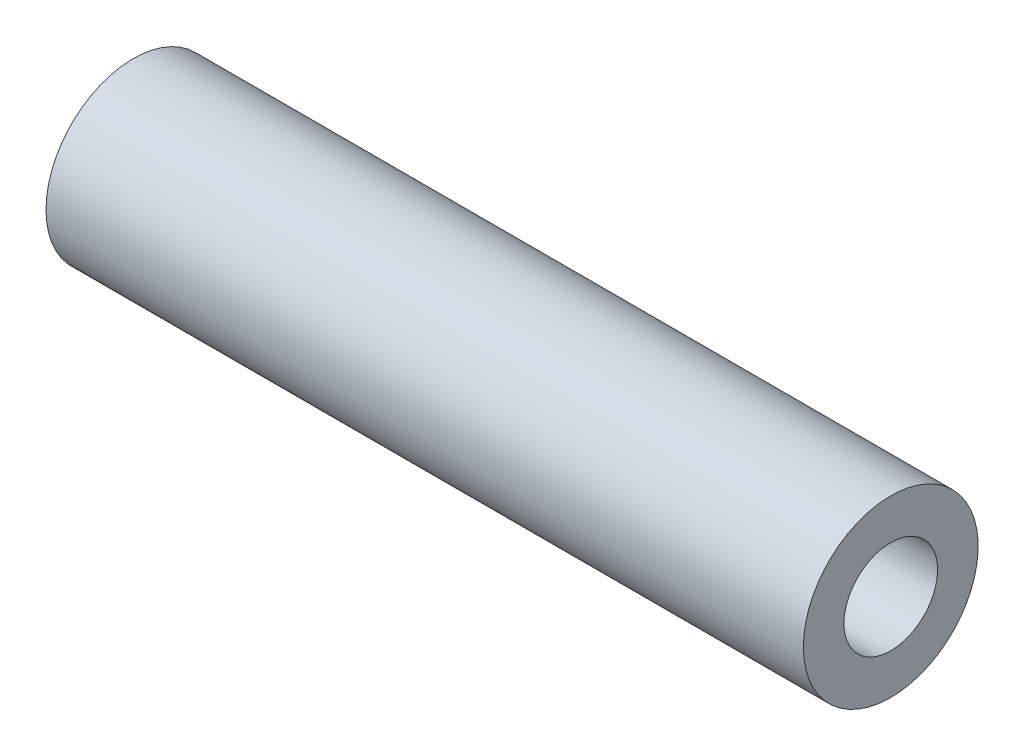
ISO-10303-21;
HEADER;
FILE_DESCRIPTION(('STEP AP214'),'2;1');
FILE_NAME('part.step','',(''),(''),'','','');
FILE_SCHEMA(('AUTOMOTIVE_DESIGN { 1 0 10303 214 1 1 1 1 }'));
ENDSEC;
DATA;
#1=APPLICATION_CONTEXT('core data for automotive mechanical design processes');
#2=APPLICATION_PROTOCOL_DEFINITION('international standard','automotive_design',2000,#1);
#3=PRODUCT_CONTEXT('',#1,'mechanical');
#4=PRODUCT('Part','Part','',(#3));
#5=PRODUCT_RELATED_PRODUCT_CATEGORY('part','',(#4));
#6=PRODUCT_DEFINITION_FORMATION('','',#4);
#7=PRODUCT_DEFINITION_CONTEXT('part definition',#1,'design');
#8=PRODUCT_DEFINITION('design','',#6,#7);
#9=PRODUCT_DEFINITION_SHAPE('','',#8);
#10=(LENGTH_UNIT() NAMED_UNIT(*) SI_UNIT(.MILLI.,.METRE.));
#11=(NAMED_UNIT(*) PLANE_ANGLE_UNIT() SI_UNIT($,.RADIAN.));
#12=(NAMED_UNIT(*) SI_UNIT($,.STERADIAN.) SOLID_ANGLE_UNIT());
#13=UNCERTAINTY_MEASURE_WITH_UNIT(LENGTH_MEASURE(1.E-05),#10,'distance_accuracy_value','');
#14=(GEOMETRIC_REPRESENTATION_CONTEXT(3) GLOBAL_UNCERTAINTY_ASSIGNED_CONTEXT((#13)) GLOBAL_UNIT_ASSIGNED_CONTEXT((#10,
#11,#12)) REPRESENTATION_CONTEXT('',''));
#15=CARTESIAN_POINT('',(0.,0.,0.));
#16=DIRECTION('',(0.,0.,1.));
#17=DIRECTION('',(1.,0.,0.));
#18=AXIS2_PLACEMENT_3D('',#15,#16,#17);
#19=CARTESIAN_POINT('',(20.6375,0.,0.));
#20=DIRECTION('',(-1.,0.,0.));
#21=DIRECTION('',(0.,0.,1.));
#22=AXIS2_PLACEMENT_3D('',#19,#20,#21);
#23=CYLINDRICAL_SURFACE('',#22,2.5527);
#24=CARTESIAN_POINT('',(-20.6375,0.,0.));
#25=DIRECTION('',(-1.,0.,0.));
#26=DIRECTION('',(0.,0.,1.));
#27=AXIS2_PLACEMENT_3D('',#24,#25,#26);
#28=CIRCLE('',#27,2.5527);
#29=CARTESIAN_POINT('',(-20.6375,0.,2.5527));
#30=VERTEX_POINT('',#29);
#31=EDGE_CURVE('E27',#30,#30,#28,.T.);
#32=ORIENTED_EDGE('',*,*,#31,.T.);
#33=EDGE_LOOP('',(#32));
#34=FACE_BOUND('',#33,.T.);
#35=CARTESIAN_POINT('',(20.6375,0.,0.));
#36=DIRECTION('',(-1.,0.,0.));
#37=DIRECTION('',(0.,0.,1.));
#38=AXIS2_PLACEMENT_3D('',#35,#36,#37);
#39=CIRCLE('',#38,2.5527);
#40=CARTESIAN_POINT('',(20.6375,0.,2.5527));
#41=VERTEX_POINT('',#40);
#42=EDGE_CURVE('E18',#41,#41,#39,.T.);
#43=ORIENTED_EDGE('',*,*,#42,.F.);
#44=EDGE_LOOP('',(#43));
#45=FACE_BOUND('',#44,.T.);
#46=ADVANCED_FACE('F15',(#34,#45),#23,.F.);
#47=CARTESIAN_POINT('',(20.6375,0.,0.));
#48=DIRECTION('',(1.,0.,0.));
#49=DIRECTION('',(0.,0.,-1.));
#50=AXIS2_PLACEMENT_3D('',#47,#48,#49);
#51=PLANE('',#50);
#52=ORIENTED_EDGE('',*,*,#42,.T.);
#53=EDGE_LOOP('',(#52));
#54=FACE_BOUND('',#53,.T.);
#55=CARTESIAN_POINT('',(20.6375,0.,0.));
#56=DIRECTION('',(-1.,0.,0.));
#57=DIRECTION('',(0.,0.,1.));
#58=AXIS2_PLACEMENT_3D('',#55,#56,#57);
#59=CIRCLE('',#58,4.7625);
#60=CARTESIAN_POINT('',(20.6375,0.,4.7625));
#61=VERTEX_POINT('',#60);
#62=EDGE_CURVE('E22',#61,#61,#59,.T.);
#63=ORIENTED_EDGE('',*,*,#62,.F.);
#64=EDGE_LOOP('',(#63));
#65=FACE_BOUND('',#64,.T.);
#66=ADVANCED_FACE('F35',(#54,#65),#51,.T.);
#67=CARTESIAN_POINT('',(-20.6375,0.,0.));
#68=DIRECTION('',(1.,0.,0.));
#69=DIRECTION('',(0.,0.,-1.));
#70=AXIS2_PLACEMENT_3D('',#67,#68,#69);
#71=PLANE('',#70);
#72=ORIENTED_EDGE('',*,*,#31,.F.);
#73=EDGE_LOOP('',(#72));
#74=FACE_BOUND('',#73,.T.);
#75=CARTESIAN_POINT('',(-20.6375,0.,0.));
#76=DIRECTION('',(-1.,0.,0.));
#77=DIRECTION('',(0.,0.,1.));
#78=AXIS2_PLACEMENT_3D('',#75,#76,#77);
#79=CIRCLE('',#78,4.7625);
#80=CARTESIAN_POINT('',(-20.6375,0.,4.7625));
#81=VERTEX_POINT('',#80);
#82=EDGE_CURVE('E10',#81,#81,#79,.F.);
#83=ORIENTED_EDGE('',*,*,#82,.F.);
#84=EDGE_LOOP('',(#83));
#85=FACE_BOUND('',#84,.T.);
#86=ADVANCED_FACE('F43',(#74,#85),#71,.F.);
#87=CARTESIAN_POINT('',(20.6375,0.,0.));
#88=DIRECTION('',(-1.,0.,0.));
#89=DIRECTION('',(0.,0.,1.));
#90=AXIS2_PLACEMENT_3D('',#87,#88,#89);
#91=CYLINDRICAL_SURFACE('',#90,4.7625);
#92=ORIENTED_EDGE('',*,*,#82,.T.);
#93=EDGE_LOOP('',(#92));
#94=FACE_BOUND('',#93,.T.);
#95=ORIENTED_EDGE('',*,*,#62,.T.);
#96=EDGE_LOOP('',(#95));
#97=FACE_BOUND('',#96,.T.);
#98=ADVANCED_FACE('F44',(#94,#97),#91,.T.);
#99=CLOSED_SHELL('',(#46,#66,#86,#98));
#100=MANIFOLD_SOLID_BREP('B1',#99);
#101=ADVANCED_BREP_SHAPE_REPRESENTATION('',(#18,#100),#14);
#102=SHAPE_DEFINITION_REPRESENTATION(#9,#101);
ENDSEC;
END-ISO-10303-21;
